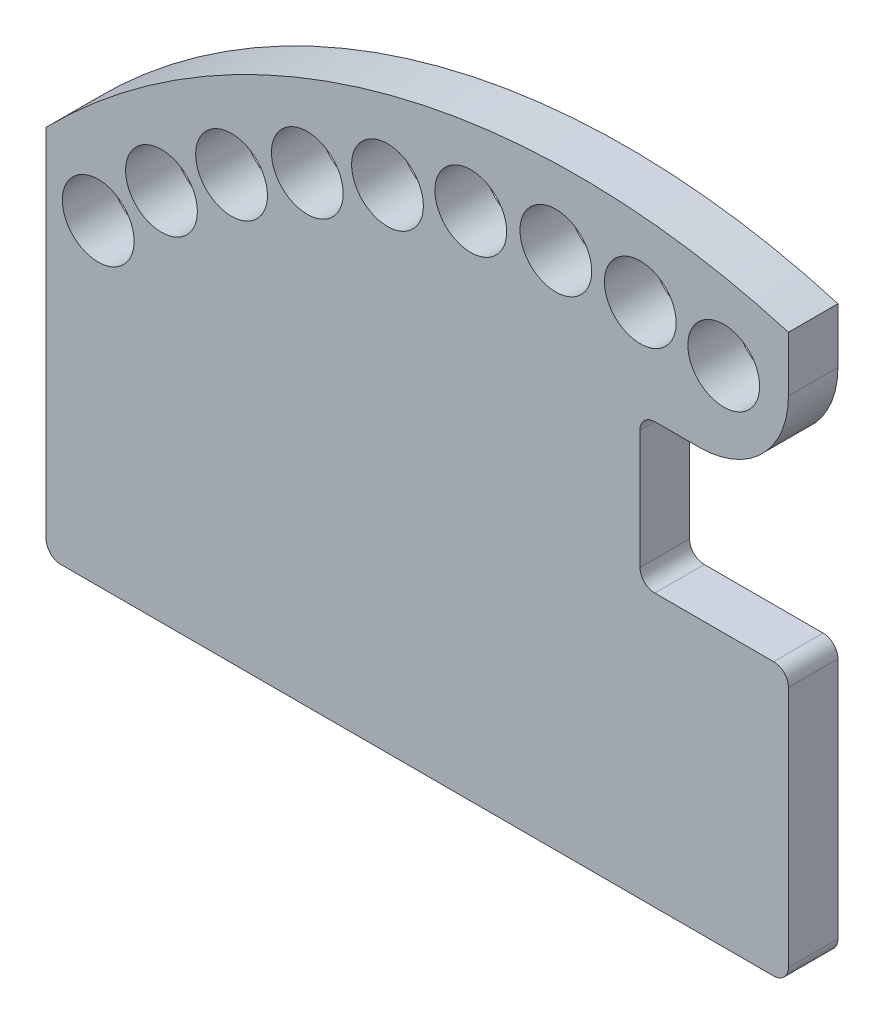
ISO-10303-21;
HEADER;
FILE_DESCRIPTION(('STEP AP214'),'2;1');
FILE_NAME('part.step','',(''),(''),'','','');
FILE_SCHEMA(('AUTOMOTIVE_DESIGN { 1 0 10303 214 1 1 1 1 }'));
ENDSEC;
DATA;
#1=APPLICATION_CONTEXT('core data for automotive mechanical design processes');
#2=APPLICATION_PROTOCOL_DEFINITION('international standard','automotive_design',2000,#1);
#3=PRODUCT_CONTEXT('',#1,'mechanical');
#4=PRODUCT('Part','Part','',(#3));
#5=PRODUCT_RELATED_PRODUCT_CATEGORY('part','',(#4));
#6=PRODUCT_DEFINITION_FORMATION('','',#4);
#7=PRODUCT_DEFINITION_CONTEXT('part definition',#1,'design');
#8=PRODUCT_DEFINITION('design','',#6,#7);
#9=PRODUCT_DEFINITION_SHAPE('','',#8);
#10=(LENGTH_UNIT() NAMED_UNIT(*) SI_UNIT(.MILLI.,.METRE.));
#11=(NAMED_UNIT(*) PLANE_ANGLE_UNIT() SI_UNIT($,.RADIAN.));
#12=(NAMED_UNIT(*) SI_UNIT($,.STERADIAN.) SOLID_ANGLE_UNIT());
#13=UNCERTAINTY_MEASURE_WITH_UNIT(LENGTH_MEASURE(1.E-05),#10,'distance_accuracy_value','');
#14=(GEOMETRIC_REPRESENTATION_CONTEXT(3) GLOBAL_UNCERTAINTY_ASSIGNED_CONTEXT((#13)) GLOBAL_UNIT_ASSIGNED_CONTEXT((#10,
#11,#12)) REPRESENTATION_CONTEXT('',''));
#15=CARTESIAN_POINT('',(0.,0.,0.));
#16=DIRECTION('',(0.,0.,1.));
#17=DIRECTION('',(1.,0.,0.));
#18=AXIS2_PLACEMENT_3D('',#15,#16,#17);
#19=CARTESIAN_POINT('',(75.,0.,10.));
#20=DIRECTION('',(-1.,0.,0.));
#21=DIRECTION('',(0.,-1.,0.));
#22=AXIS2_PLACEMENT_3D('',#19,#20,#21);
#23=PLANE('',#22);
#24=DIRECTION('',(0.,1.,0.));
#25=VECTOR('',#24,1.);
#26=CARTESIAN_POINT('',(75.,0.,10.));
#27=LINE('',#26,#25);
#28=CARTESIAN_POINT('',(75.,3.00000000000003,10.));
#29=VERTEX_POINT('',#28);
#30=CARTESIAN_POINT('',(75.,52.,10.));
#31=VERTEX_POINT('',#30);
#32=EDGE_CURVE('E142',#29,#31,#27,.T.);
#33=ORIENTED_EDGE('',*,*,#32,.F.);
#34=DIRECTION('',(0.,0.,-1.));
#35=VECTOR('',#34,1.);
#36=CARTESIAN_POINT('',(75.,3.00000000000003,10.));
#37=LINE('',#36,#35);
#38=CARTESIAN_POINT('',(75.,3.00000000000003,0.));
#39=VERTEX_POINT('',#38);
#40=EDGE_CURVE('E193',#29,#39,#37,.T.);
#41=ORIENTED_EDGE('',*,*,#40,.T.);
#42=DIRECTION('',(0.,1.,0.));
#43=VECTOR('',#42,1.);
#44=CARTESIAN_POINT('',(75.,0.,0.));
#45=LINE('',#44,#43);
#46=CARTESIAN_POINT('',(75.,52.,0.));
#47=VERTEX_POINT('',#46);
#48=EDGE_CURVE('E299',#39,#47,#45,.T.);
#49=ORIENTED_EDGE('',*,*,#48,.T.);
#50=DIRECTION('',(0.,0.,1.));
#51=VECTOR('',#50,1.);
#52=CARTESIAN_POINT('',(75.,52.,10.));
#53=LINE('',#52,#51);
#54=EDGE_CURVE('E190',#47,#31,#53,.T.);
#55=ORIENTED_EDGE('',*,*,#54,.T.);
#56=EDGE_LOOP('',(#33,#41,#49,#55));
#57=FACE_BOUND('',#56,.T.);
#58=ADVANCED_FACE('F32',(#57),#23,.F.);
#59=CARTESIAN_POINT('',(75.,103.,10.));
#60=VERTEX_POINT('',#59);
#61=CARTESIAN_POINT('',(75.,114.135353053996,10.));
#62=VERTEX_POINT('',#61);
#63=EDGE_CURVE('E131',#60,#62,#27,.T.);
#64=ORIENTED_EDGE('',*,*,#63,.F.);
#65=DIRECTION('',(0.,0.,1.));
#66=VECTOR('',#65,1.);
#67=CARTESIAN_POINT('',(75.,103.,10.));
#68=LINE('',#67,#66);
#69=CARTESIAN_POINT('',(75.,103.,0.));
#70=VERTEX_POINT('',#69);
#71=EDGE_CURVE('E167',#60,#70,#68,.F.);
#72=ORIENTED_EDGE('',*,*,#71,.T.);
#73=CARTESIAN_POINT('',(75.,114.135353053996,0.));
#74=VERTEX_POINT('',#73);
#75=EDGE_CURVE('E156',#70,#74,#45,.T.);
#76=ORIENTED_EDGE('',*,*,#75,.T.);
#77=DIRECTION('',(0.,0.,-1.));
#78=VECTOR('',#77,1.);
#79=CARTESIAN_POINT('',(75.,114.135353053996,10.));
#80=LINE('',#79,#78);
#81=EDGE_CURVE('E148',#62,#74,#80,.T.);
#82=ORIENTED_EDGE('',*,*,#81,.F.);
#83=EDGE_LOOP('',(#64,#72,#76,#82));
#84=FACE_BOUND('',#83,.T.);
#85=ADVANCED_FACE('F154',(#84),#23,.F.);
#86=CARTESIAN_POINT('',(32.5,-30.,10.));
#87=DIRECTION('',(0.,0.,-1.));
#88=DIRECTION('',(-1.,0.,0.));
#89=AXIS2_PLACEMENT_3D('',#86,#87,#88);
#90=CYLINDRICAL_SURFACE('',#89,150.270589271487);
#91=CARTESIAN_POINT('',(32.5,-30.,0.));
#92=DIRECTION('',(0.,0.,1.));
#93=DIRECTION('',(-1.,0.,0.));
#94=AXIS2_PLACEMENT_3D('',#91,#92,#93);
#95=CIRCLE('',#94,150.270589271487);
#96=CARTESIAN_POINT('',(-75.,75.,0.));
#97=VERTEX_POINT('',#96);
#98=EDGE_CURVE('E302',#74,#97,#95,.T.);
#99=ORIENTED_EDGE('',*,*,#98,.T.);
#100=DIRECTION('',(0.,0.,-1.));
#101=VECTOR('',#100,1.);
#102=CARTESIAN_POINT('',(-75.,75.,10.));
#103=LINE('',#102,#101);
#104=CARTESIAN_POINT('',(-75.,75.,10.));
#105=VERTEX_POINT('',#104);
#106=EDGE_CURVE('E150',#105,#97,#103,.T.);
#107=ORIENTED_EDGE('',*,*,#106,.F.);
#108=CARTESIAN_POINT('',(32.5,-30.,10.));
#109=DIRECTION('',(0.,0.,1.));
#110=DIRECTION('',(-1.,0.,0.));
#111=AXIS2_PLACEMENT_3D('',#108,#109,#110);
#112=CIRCLE('',#111,150.270589271487);
#113=EDGE_CURVE('E135',#62,#105,#112,.T.);
#114=ORIENTED_EDGE('',*,*,#113,.F.);
#115=ORIENTED_EDGE('',*,*,#81,.T.);
#116=EDGE_LOOP('',(#99,#107,#114,#115));
#117=FACE_BOUND('',#116,.T.);
#118=ADVANCED_FACE('F147',(#117),#90,.T.);
#119=CARTESIAN_POINT('',(-75.,0.,10.));
#120=DIRECTION('',(1.,0.,0.));
#121=DIRECTION('',(0.,0.,-1.));
#122=AXIS2_PLACEMENT_3D('',#119,#120,#121);
#123=PLANE('',#122);
#124=DIRECTION('',(0.,-1.,0.));
#125=VECTOR('',#124,1.);
#126=CARTESIAN_POINT('',(-75.,0.,0.));
#127=LINE('',#126,#125);
#128=CARTESIAN_POINT('',(-75.,2.99999999999998,0.));
#129=VERTEX_POINT('',#128);
#130=EDGE_CURVE('E304',#97,#129,#127,.T.);
#131=ORIENTED_EDGE('',*,*,#130,.T.);
#132=DIRECTION('',(0.,0.,-1.));
#133=VECTOR('',#132,1.);
#134=CARTESIAN_POINT('',(-75.,2.99999999999998,10.));
#135=LINE('',#134,#133);
#136=CARTESIAN_POINT('',(-75.,2.99999999999998,10.));
#137=VERTEX_POINT('',#136);
#138=EDGE_CURVE('E182',#129,#137,#135,.F.);
#139=ORIENTED_EDGE('',*,*,#138,.T.);
#140=DIRECTION('',(0.,-1.,0.));
#141=VECTOR('',#140,1.);
#142=CARTESIAN_POINT('',(-75.,0.,10.));
#143=LINE('',#142,#141);
#144=EDGE_CURVE('E152',#105,#137,#143,.T.);
#145=ORIENTED_EDGE('',*,*,#144,.F.);
#146=ORIENTED_EDGE('',*,*,#106,.T.);
#147=EDGE_LOOP('',(#131,#139,#145,#146));
#148=FACE_BOUND('',#147,.T.);
#149=ADVANCED_FACE('F516',(#148),#123,.F.);
#150=CARTESIAN_POINT('',(75.,0.,10.));
#151=DIRECTION('',(0.,1.,0.));
#152=DIRECTION('',(-1.,0.,0.));
#153=AXIS2_PLACEMENT_3D('',#150,#151,#152);
#154=PLANE('',#153);
#155=DIRECTION('',(1.,0.,0.));
#156=VECTOR('',#155,1.);
#157=CARTESIAN_POINT('',(75.,0.,10.));
#158=LINE('',#157,#156);
#159=CARTESIAN_POINT('',(-72.,0.,10.));
#160=VERTEX_POINT('',#159);
#161=CARTESIAN_POINT('',(72.,0.,10.));
#162=VERTEX_POINT('',#161);
#163=EDGE_CURVE('E162',#160,#162,#158,.T.);
#164=ORIENTED_EDGE('',*,*,#163,.F.);
#165=DIRECTION('',(0.,0.,-1.));
#166=VECTOR('',#165,1.);
#167=CARTESIAN_POINT('',(-72.,0.,10.));
#168=LINE('',#167,#166);
#169=CARTESIAN_POINT('',(-72.,0.,0.));
#170=VERTEX_POINT('',#169);
#171=EDGE_CURVE('E173',#160,#170,#168,.T.);
#172=ORIENTED_EDGE('',*,*,#171,.T.);
#173=DIRECTION('',(1.,0.,0.));
#174=VECTOR('',#173,1.);
#175=CARTESIAN_POINT('',(75.,0.,0.));
#176=LINE('',#175,#174);
#177=CARTESIAN_POINT('',(72.,0.,0.));
#178=VERTEX_POINT('',#177);
#179=EDGE_CURVE('E143',#170,#178,#176,.T.);
#180=ORIENTED_EDGE('',*,*,#179,.T.);
#181=DIRECTION('',(0.,0.,-1.));
#182=VECTOR('',#181,1.);
#183=CARTESIAN_POINT('',(72.,0.,10.));
#184=LINE('',#183,#182);
#185=EDGE_CURVE('E171',#178,#162,#184,.F.);
#186=ORIENTED_EDGE('',*,*,#185,.T.);
#187=EDGE_LOOP('',(#164,#172,#180,#186));
#188=FACE_BOUND('',#187,.T.);
#189=ADVANCED_FACE('F310',(#188),#154,.F.);
#190=CARTESIAN_POINT('',(32.5,-30.,10.));
#191=DIRECTION('',(0.,0.,-1.));
#192=DIRECTION('',(-1.,0.,0.));
#193=AXIS2_PLACEMENT_3D('',#190,#191,#192);
#194=PLANE('',#193);
#195=CARTESIAN_POINT('',(61.9258524461941,101.754010215305,10.));
#196=DIRECTION('',(0.,0.,1.));
#197=DIRECTION('',(0.968147640378108,-0.250380004054442,0.));
#198=AXIS2_PLACEMENT_3D('',#195,#196,#197);
#199=CIRCLE('',#198,7.25000000000001);
#200=CARTESIAN_POINT('',(68.9449228389354,99.9387551859108,10.));
#201=VERTEX_POINT('',#200);
#202=EDGE_CURVE('E234',#201,#201,#199,.T.);
#203=ORIENTED_EDGE('',*,*,#202,.F.);
#204=EDGE_LOOP('',(#203));
#205=FACE_BOUND('',#204,.T.);
#206=CARTESIAN_POINT('',(45.0633710064863,104.414142518387,10.));
#207=DIRECTION('',(0.,0.,1.));
#208=DIRECTION('',(0.992004949679715,-0.12619896913583,0.));
#209=AXIS2_PLACEMENT_3D('',#206,#207,#208);
#210=CIRCLE('',#209,7.25000000000001);
#211=CARTESIAN_POINT('',(52.2554068916642,103.499199992153,10.));
#212=VERTEX_POINT('',#211);
#213=EDGE_CURVE('E245',#212,#212,#210,.T.);
#214=ORIENTED_EDGE('',*,*,#213,.F.);
#215=EDGE_LOOP('',(#214));
#216=FACE_BOUND('',#215,.T.);
#217=CARTESIAN_POINT('',(-64.4637952556092,63.9309448990496,10.));
#218=DIRECTION('',(0.,0.,1.));
#219=DIRECTION('',(0.71933980033865,0.694658370458998,0.));
#220=AXIS2_PLACEMENT_3D('',#217,#218,#219);
#221=CIRCLE('',#220,7.25000000000001);
#222=CARTESIAN_POINT('',(-59.248581703154,68.9672180848773,10.));
#223=VERTEX_POINT('',#222);
#224=EDGE_CURVE('E251',#223,#223,#221,.T.);
#225=ORIENTED_EDGE('',*,*,#224,.F.);
#226=EDGE_LOOP('',(#225));
#227=FACE_BOUND('',#226,.T.);
#228=CARTESIAN_POINT('',(-51.6811649051759,75.5392413996215,10.));
#229=DIRECTION('',(0.,0.,1.));
#230=DIRECTION('',(0.802123192755043,0.597158591702787,0.));
#231=AXIS2_PLACEMENT_3D('',#228,#229,#230);
#232=CIRCLE('',#231,7.25000000000001);
#233=CARTESIAN_POINT('',(-45.8657717577018,79.8686411894667,10.));
#234=VERTEX_POINT('',#233);
#235=EDGE_CURVE('E257',#234,#234,#232,.T.);
#236=ORIENTED_EDGE('',*,*,#235,.F.);
#237=EDGE_LOOP('',(#236));
#238=FACE_BOUND('',#237,.T.);
#239=CARTESIAN_POINT('',(-37.5213898831997,85.4209901136918,10.));
#240=DIRECTION('',(0.,0.,1.));
#241=DIRECTION('',(0.871784413696762,0.489889718238088,0.));
#242=AXIS2_PLACEMENT_3D('',#239,#240,#241);
#243=CIRCLE('',#242,7.25000000000001);
#244=CARTESIAN_POINT('',(-31.2009528838981,88.972690570918,10.));
#245=VERTEX_POINT('',#244);
#246=EDGE_CURVE('E263',#245,#245,#243,.T.);
#247=ORIENTED_EDGE('',*,*,#246,.F.);
#248=EDGE_LOOP('',(#247));
#249=FACE_BOUND('',#248,.T.);
#250=CARTESIAN_POINT('',(-22.2161141535498,93.4145325799831,10.));
#251=DIRECTION('',(0.,0.,1.));
#252=DIRECTION('',(0.927183854566787,0.374606593415913,0.));
#253=AXIS2_PLACEMENT_3D('',#250,#251,#252);
#254=CIRCLE('',#253,7.25000000000001);
#255=CARTESIAN_POINT('',(-15.4940312079406,96.1304303822485,10.));
#256=VERTEX_POINT('',#255);
#257=EDGE_CURVE('E269',#256,#256,#254,.T.);
#258=ORIENTED_EDGE('',*,*,#257,.F.);
#259=EDGE_LOOP('',(#258));
#260=FACE_BOUND('',#259,.T.);
#261=CARTESIAN_POINT('',(-6.01572126629146,99.3891000638669,10.));
#262=DIRECTION('',(0.,0.,1.));
#263=DIRECTION('',(0.967415219462864,0.253195168104802,0.));
#264=AXIS2_PLACEMENT_3D('',#261,#262,#263);
#265=CIRCLE('',#264,7.25000000000001);
#266=CARTESIAN_POINT('',(0.998039074814315,101.224765032627,10.));
#267=VERTEX_POINT('',#266);
#268=EDGE_CURVE('E275',#267,#267,#265,.T.);
#269=ORIENTED_EDGE('',*,*,#268,.F.);
#270=EDGE_LOOP('',(#269));
#271=FACE_BOUND('',#270,.T.);
#272=CARTESIAN_POINT('',(10.8147617411529,103.246952841921,10.));
#273=DIRECTION('',(0.,0.,1.));
#274=DIRECTION('',(0.991820351541262,0.127641647860595,0.));
#275=AXIS2_PLACEMENT_3D('',#272,#273,#274);
#276=CIRCLE('',#275,7.25000000000001);
#277=CARTESIAN_POINT('',(18.0054592898271,104.17235478891,10.));
#278=VERTEX_POINT('',#277);
#279=EDGE_CURVE('E281',#278,#278,#276,.T.);
#280=ORIENTED_EDGE('',*,*,#279,.F.);
#281=EDGE_LOOP('',(#280));
#282=FACE_BOUND('',#281,.T.);
#283=CARTESIAN_POINT('',(28.,104.924979155085,10.));
#284=DIRECTION('',(0.,0.,1.));
#285=DIRECTION('',(1.,0.,0.));
#286=AXIS2_PLACEMENT_3D('',#283,#284,#285);
#287=CIRCLE('',#286,7.25000000000001);
#288=CARTESIAN_POINT('',(35.25,104.924979155085,10.));
#289=VERTEX_POINT('',#288);
#290=EDGE_CURVE('E287',#289,#289,#287,.T.);
#291=ORIENTED_EDGE('',*,*,#290,.F.);
#292=EDGE_LOOP('',(#291));
#293=FACE_BOUND('',#292,.T.);
#294=ORIENTED_EDGE('',*,*,#144,.T.);
#295=CARTESIAN_POINT('',(-72.,2.99999999999998,10.));
#296=DIRECTION('',(0.,0.,-1.));
#297=DIRECTION('',(-1.,0.,0.));
#298=AXIS2_PLACEMENT_3D('',#295,#296,#297);
#299=CIRCLE('',#298,3.);
#300=EDGE_CURVE('E188',#137,#160,#299,.F.);
#301=ORIENTED_EDGE('',*,*,#300,.T.);
#302=ORIENTED_EDGE('',*,*,#163,.T.);
#303=CARTESIAN_POINT('',(72.,3.00000000000003,10.));
#304=DIRECTION('',(0.,0.,-1.));
#305=DIRECTION('',(-1.,0.,0.));
#306=AXIS2_PLACEMENT_3D('',#303,#304,#305);
#307=CIRCLE('',#306,3.);
#308=EDGE_CURVE('E186',#162,#29,#307,.F.);
#309=ORIENTED_EDGE('',*,*,#308,.T.);
#310=ORIENTED_EDGE('',*,*,#32,.T.);
#311=CARTESIAN_POINT('',(72.,52.,10.));
#312=DIRECTION('',(0.,0.,-1.));
#313=DIRECTION('',(-1.,0.,0.));
#314=AXIS2_PLACEMENT_3D('',#311,#312,#313);
#315=CIRCLE('',#314,3.);
#316=CARTESIAN_POINT('',(72.,55.,10.));
#317=VERTEX_POINT('',#316);
#318=EDGE_CURVE('E184',#31,#317,#315,.F.);
#319=ORIENTED_EDGE('',*,*,#318,.T.);
#320=DIRECTION('',(1.,0.,0.));
#321=VECTOR('',#320,1.);
#322=CARTESIAN_POINT('',(45.,55.,10.));
#323=LINE('',#322,#321);
#324=CARTESIAN_POINT('',(48.,55.,10.));
#325=VERTEX_POINT('',#324);
#326=EDGE_CURVE('E236',#325,#317,#323,.T.);
#327=ORIENTED_EDGE('',*,*,#326,.F.);
#328=CARTESIAN_POINT('',(48.,58.,10.));
#329=DIRECTION('',(0.,0.,-1.));
#330=DIRECTION('',(-1.,0.,0.));
#331=AXIS2_PLACEMENT_3D('',#328,#329,#330);
#332=CIRCLE('',#331,3.);
#333=CARTESIAN_POINT('',(45.,58.,10.));
#334=VERTEX_POINT('',#333);
#335=EDGE_CURVE('E47',#325,#334,#332,.T.);
#336=ORIENTED_EDGE('',*,*,#335,.T.);
#337=DIRECTION('',(0.,-1.,0.));
#338=VECTOR('',#337,1.);
#339=CARTESIAN_POINT('',(45.,85.,10.));
#340=LINE('',#339,#338);
#341=CARTESIAN_POINT('',(45.,82.,10.));
#342=VERTEX_POINT('',#341);
#343=EDGE_CURVE('E211',#342,#334,#340,.T.);
#344=ORIENTED_EDGE('',*,*,#343,.F.);
#345=CARTESIAN_POINT('',(48.,82.,10.));
#346=DIRECTION('',(0.,0.,-1.));
#347=DIRECTION('',(-1.,0.,0.));
#348=AXIS2_PLACEMENT_3D('',#345,#346,#347);
#349=CIRCLE('',#348,3.);
#350=CARTESIAN_POINT('',(48.,85.,10.));
#351=VERTEX_POINT('',#350);
#352=EDGE_CURVE('E40',#342,#351,#349,.T.);
#353=ORIENTED_EDGE('',*,*,#352,.T.);
#354=DIRECTION('',(-1.,0.,0.));
#355=VECTOR('',#354,1.);
#356=CARTESIAN_POINT('',(75.,85.,10.));
#357=LINE('',#356,#355);
#358=CARTESIAN_POINT('',(57.,85.,10.));
#359=VERTEX_POINT('',#358);
#360=EDGE_CURVE('E210',#359,#351,#357,.T.);
#361=ORIENTED_EDGE('',*,*,#360,.F.);
#362=CARTESIAN_POINT('',(57.,103.,10.));
#363=DIRECTION('',(0.,0.,-1.));
#364=DIRECTION('',(-1.,0.,0.));
#365=AXIS2_PLACEMENT_3D('',#362,#363,#364);
#366=CIRCLE('',#365,18.);
#367=EDGE_CURVE('E138',#359,#60,#366,.F.);
#368=ORIENTED_EDGE('',*,*,#367,.T.);
#369=ORIENTED_EDGE('',*,*,#63,.T.);
#370=ORIENTED_EDGE('',*,*,#113,.T.);
#371=EDGE_LOOP('',(#294,#301,#302,#309,#310,#319,#327,#336,#344,#353,#361,#368,#369,#370));
#372=FACE_BOUND('',#371,.T.);
#373=ADVANCED_FACE('F134',(#205,#216,#227,#238,#249,#260,#271,#282,#293,#372),#194,.F.);
#374=CARTESIAN_POINT('',(32.5,-30.,0.));
#375=DIRECTION('',(0.,0.,-1.));
#376=DIRECTION('',(-1.,0.,0.));
#377=AXIS2_PLACEMENT_3D('',#374,#375,#376);
#378=PLANE('',#377);
#379=ORIENTED_EDGE('',*,*,#179,.F.);
#380=CARTESIAN_POINT('',(-72.,2.99999999999998,0.));
#381=DIRECTION('',(0.,0.,-1.));
#382=DIRECTION('',(-1.,0.,0.));
#383=AXIS2_PLACEMENT_3D('',#380,#381,#382);
#384=CIRCLE('',#383,3.);
#385=EDGE_CURVE('E180',#170,#129,#384,.T.);
#386=ORIENTED_EDGE('',*,*,#385,.T.);
#387=ORIENTED_EDGE('',*,*,#130,.F.);
#388=ORIENTED_EDGE('',*,*,#98,.F.);
#389=ORIENTED_EDGE('',*,*,#75,.F.);
#390=CARTESIAN_POINT('',(57.,103.,0.));
#391=DIRECTION('',(0.,0.,-1.));
#392=DIRECTION('',(-1.,0.,0.));
#393=AXIS2_PLACEMENT_3D('',#390,#391,#392);
#394=CIRCLE('',#393,18.);
#395=CARTESIAN_POINT('',(57.,85.,0.));
#396=VERTEX_POINT('',#395);
#397=EDGE_CURVE('E169',#70,#396,#394,.T.);
#398=ORIENTED_EDGE('',*,*,#397,.T.);
#399=DIRECTION('',(-1.,0.,0.));
#400=VECTOR('',#399,1.);
#401=CARTESIAN_POINT('',(75.,85.,0.));
#402=LINE('',#401,#400);
#403=CARTESIAN_POINT('',(48.,85.,0.));
#404=VERTEX_POINT('',#403);
#405=EDGE_CURVE('E227',#396,#404,#402,.T.);
#406=ORIENTED_EDGE('',*,*,#405,.T.);
#407=CARTESIAN_POINT('',(48.,82.,0.));
#408=DIRECTION('',(0.,0.,-1.));
#409=DIRECTION('',(-1.,0.,0.));
#410=AXIS2_PLACEMENT_3D('',#407,#408,#409);
#411=CIRCLE('',#410,3.);
#412=CARTESIAN_POINT('',(45.,82.,0.));
#413=VERTEX_POINT('',#412);
#414=EDGE_CURVE('E11',#404,#413,#411,.F.);
#415=ORIENTED_EDGE('',*,*,#414,.T.);
#416=DIRECTION('',(0.,-1.,0.));
#417=VECTOR('',#416,1.);
#418=CARTESIAN_POINT('',(45.,85.,0.));
#419=LINE('',#418,#417);
#420=CARTESIAN_POINT('',(45.,58.,0.));
#421=VERTEX_POINT('',#420);
#422=EDGE_CURVE('E225',#413,#421,#419,.T.);
#423=ORIENTED_EDGE('',*,*,#422,.T.);
#424=CARTESIAN_POINT('',(48.,58.,0.));
#425=DIRECTION('',(0.,0.,-1.));
#426=DIRECTION('',(-1.,0.,0.));
#427=AXIS2_PLACEMENT_3D('',#424,#425,#426);
#428=CIRCLE('',#427,3.);
#429=CARTESIAN_POINT('',(48.,55.,0.));
#430=VERTEX_POINT('',#429);
#431=EDGE_CURVE('E208',#421,#430,#428,.F.);
#432=ORIENTED_EDGE('',*,*,#431,.T.);
#433=DIRECTION('',(1.,0.,0.));
#434=VECTOR('',#433,1.);
#435=CARTESIAN_POINT('',(45.,55.,0.));
#436=LINE('',#435,#434);
#437=CARTESIAN_POINT('',(72.,55.,0.));
#438=VERTEX_POINT('',#437);
#439=EDGE_CURVE('E231',#430,#438,#436,.T.);
#440=ORIENTED_EDGE('',*,*,#439,.T.);
#441=CARTESIAN_POINT('',(72.,52.,0.));
#442=DIRECTION('',(0.,0.,-1.));
#443=DIRECTION('',(-1.,0.,0.));
#444=AXIS2_PLACEMENT_3D('',#441,#442,#443);
#445=CIRCLE('',#444,3.);
#446=EDGE_CURVE('E176',#438,#47,#445,.T.);
#447=ORIENTED_EDGE('',*,*,#446,.T.);
#448=ORIENTED_EDGE('',*,*,#48,.F.);
#449=CARTESIAN_POINT('',(72.,3.00000000000003,0.));
#450=DIRECTION('',(0.,0.,-1.));
#451=DIRECTION('',(-1.,0.,0.));
#452=AXIS2_PLACEMENT_3D('',#449,#450,#451);
#453=CIRCLE('',#452,3.);
#454=EDGE_CURVE('E178',#39,#178,#453,.T.);
#455=ORIENTED_EDGE('',*,*,#454,.T.);
#456=EDGE_LOOP('',(#379,#386,#387,#388,#389,#398,#406,#415,#423,#432,#440,#447,#448,#455));
#457=FACE_BOUND('',#456,.T.);
#458=CARTESIAN_POINT('',(61.9258524461941,101.754010215305,0.));
#459=DIRECTION('',(0.,0.,1.));
#460=DIRECTION('',(0.968147640378108,-0.250380004054442,0.));
#461=AXIS2_PLACEMENT_3D('',#458,#459,#460);
#462=CIRCLE('',#461,7.25000000000001);
#463=CARTESIAN_POINT('',(68.9449228389354,99.9387551859108,0.));
#464=VERTEX_POINT('',#463);
#465=EDGE_CURVE('E242',#464,#464,#462,.T.);
#466=ORIENTED_EDGE('',*,*,#465,.T.);
#467=EDGE_LOOP('',(#466));
#468=FACE_BOUND('',#467,.T.);
#469=CARTESIAN_POINT('',(45.0633710064863,104.414142518387,0.));
#470=DIRECTION('',(0.,0.,1.));
#471=DIRECTION('',(0.992004949679715,-0.12619896913583,0.));
#472=AXIS2_PLACEMENT_3D('',#469,#470,#471);
#473=CIRCLE('',#472,7.25000000000001);
#474=CARTESIAN_POINT('',(52.2554068916642,103.499199992153,0.));
#475=VERTEX_POINT('',#474);
#476=EDGE_CURVE('E248',#475,#475,#473,.T.);
#477=ORIENTED_EDGE('',*,*,#476,.T.);
#478=EDGE_LOOP('',(#477));
#479=FACE_BOUND('',#478,.T.);
#480=CARTESIAN_POINT('',(-64.4637952556092,63.9309448990496,0.));
#481=DIRECTION('',(0.,0.,1.));
#482=DIRECTION('',(0.71933980033865,0.694658370458998,0.));
#483=AXIS2_PLACEMENT_3D('',#480,#481,#482);
#484=CIRCLE('',#483,7.25000000000001);
#485=CARTESIAN_POINT('',(-59.248581703154,68.9672180848773,0.));
#486=VERTEX_POINT('',#485);
#487=EDGE_CURVE('E254',#486,#486,#484,.T.);
#488=ORIENTED_EDGE('',*,*,#487,.T.);
#489=EDGE_LOOP('',(#488));
#490=FACE_BOUND('',#489,.T.);
#491=CARTESIAN_POINT('',(-51.6811649051759,75.5392413996215,0.));
#492=DIRECTION('',(0.,0.,1.));
#493=DIRECTION('',(0.802123192755043,0.597158591702787,0.));
#494=AXIS2_PLACEMENT_3D('',#491,#492,#493);
#495=CIRCLE('',#494,7.25000000000001);
#496=CARTESIAN_POINT('',(-45.8657717577018,79.8686411894667,0.));
#497=VERTEX_POINT('',#496);
#498=EDGE_CURVE('E260',#497,#497,#495,.T.);
#499=ORIENTED_EDGE('',*,*,#498,.T.);
#500=EDGE_LOOP('',(#499));
#501=FACE_BOUND('',#500,.T.);
#502=CARTESIAN_POINT('',(-37.5213898831997,85.4209901136918,0.));
#503=DIRECTION('',(0.,0.,1.));
#504=DIRECTION('',(0.871784413696762,0.489889718238088,0.));
#505=AXIS2_PLACEMENT_3D('',#502,#503,#504);
#506=CIRCLE('',#505,7.25000000000001);
#507=CARTESIAN_POINT('',(-31.2009528838981,88.972690570918,0.));
#508=VERTEX_POINT('',#507);
#509=EDGE_CURVE('E266',#508,#508,#506,.T.);
#510=ORIENTED_EDGE('',*,*,#509,.T.);
#511=EDGE_LOOP('',(#510));
#512=FACE_BOUND('',#511,.T.);
#513=CARTESIAN_POINT('',(-22.2161141535498,93.4145325799831,0.));
#514=DIRECTION('',(0.,0.,1.));
#515=DIRECTION('',(0.927183854566787,0.374606593415913,0.));
#516=AXIS2_PLACEMENT_3D('',#513,#514,#515);
#517=CIRCLE('',#516,7.25000000000001);
#518=CARTESIAN_POINT('',(-15.4940312079406,96.1304303822485,0.));
#519=VERTEX_POINT('',#518);
#520=EDGE_CURVE('E272',#519,#519,#517,.T.);
#521=ORIENTED_EDGE('',*,*,#520,.T.);
#522=EDGE_LOOP('',(#521));
#523=FACE_BOUND('',#522,.T.);
#524=CARTESIAN_POINT('',(-6.01572126629146,99.3891000638669,0.));
#525=DIRECTION('',(0.,0.,1.));
#526=DIRECTION('',(0.967415219462864,0.253195168104802,0.));
#527=AXIS2_PLACEMENT_3D('',#524,#525,#526);
#528=CIRCLE('',#527,7.25000000000001);
#529=CARTESIAN_POINT('',(0.998039074814315,101.224765032627,0.));
#530=VERTEX_POINT('',#529);
#531=EDGE_CURVE('E278',#530,#530,#528,.T.);
#532=ORIENTED_EDGE('',*,*,#531,.T.);
#533=EDGE_LOOP('',(#532));
#534=FACE_BOUND('',#533,.T.);
#535=CARTESIAN_POINT('',(10.8147617411529,103.246952841921,0.));
#536=DIRECTION('',(0.,0.,1.));
#537=DIRECTION('',(0.991820351541262,0.127641647860595,0.));
#538=AXIS2_PLACEMENT_3D('',#535,#536,#537);
#539=CIRCLE('',#538,7.25000000000001);
#540=CARTESIAN_POINT('',(18.0054592898271,104.17235478891,0.));
#541=VERTEX_POINT('',#540);
#542=EDGE_CURVE('E284',#541,#541,#539,.T.);
#543=ORIENTED_EDGE('',*,*,#542,.T.);
#544=EDGE_LOOP('',(#543));
#545=FACE_BOUND('',#544,.T.);
#546=CARTESIAN_POINT('',(28.,104.924979155085,0.));
#547=DIRECTION('',(0.,0.,1.));
#548=DIRECTION('',(1.,0.,0.));
#549=AXIS2_PLACEMENT_3D('',#546,#547,#548);
#550=CIRCLE('',#549,7.25000000000001);
#551=CARTESIAN_POINT('',(35.25,104.924979155085,0.));
#552=VERTEX_POINT('',#551);
#553=EDGE_CURVE('E290',#552,#552,#550,.T.);
#554=ORIENTED_EDGE('',*,*,#553,.T.);
#555=EDGE_LOOP('',(#554));
#556=FACE_BOUND('',#555,.T.);
#557=ADVANCED_FACE('F223',(#457,#468,#479,#490,#501,#512,#523,#534,#545,#556),#378,.T.);
#558=CARTESIAN_POINT('',(28.,104.924979155085,0.));
#559=DIRECTION('',(0.,0.,1.));
#560=DIRECTION('',(1.,0.,0.));
#561=AXIS2_PLACEMENT_3D('',#558,#559,#560);
#562=CYLINDRICAL_SURFACE('',#561,7.25000000000001);
#563=ORIENTED_EDGE('',*,*,#553,.F.);
#564=EDGE_LOOP('',(#563));
#565=FACE_BOUND('',#564,.T.);
#566=ORIENTED_EDGE('',*,*,#290,.T.);
#567=EDGE_LOOP('',(#566));
#568=FACE_BOUND('',#567,.T.);
#569=ADVANCED_FACE('F484',(#565,#568),#562,.F.);
#570=CARTESIAN_POINT('',(10.8147617411529,103.246952841921,0.));
#571=DIRECTION('',(0.,0.,1.));
#572=DIRECTION('',(1.,0.,0.));
#573=AXIS2_PLACEMENT_3D('',#570,#571,#572);
#574=CYLINDRICAL_SURFACE('',#573,7.25000000000001);
#575=ORIENTED_EDGE('',*,*,#542,.F.);
#576=EDGE_LOOP('',(#575));
#577=FACE_BOUND('',#576,.T.);
#578=ORIENTED_EDGE('',*,*,#279,.T.);
#579=EDGE_LOOP('',(#578));
#580=FACE_BOUND('',#579,.T.);
#581=ADVANCED_FACE('F475',(#577,#580),#574,.F.);
#582=CARTESIAN_POINT('',(-6.01572126629146,99.3891000638669,0.));
#583=DIRECTION('',(0.,0.,1.));
#584=DIRECTION('',(1.,0.,0.));
#585=AXIS2_PLACEMENT_3D('',#582,#583,#584);
#586=CYLINDRICAL_SURFACE('',#585,7.25000000000001);
#587=ORIENTED_EDGE('',*,*,#531,.F.);
#588=EDGE_LOOP('',(#587));
#589=FACE_BOUND('',#588,.T.);
#590=ORIENTED_EDGE('',*,*,#268,.T.);
#591=EDGE_LOOP('',(#590));
#592=FACE_BOUND('',#591,.T.);
#593=ADVANCED_FACE('F466',(#589,#592),#586,.F.);
#594=CARTESIAN_POINT('',(-22.2161141535498,93.4145325799831,0.));
#595=DIRECTION('',(0.,0.,1.));
#596=DIRECTION('',(1.,0.,0.));
#597=AXIS2_PLACEMENT_3D('',#594,#595,#596);
#598=CYLINDRICAL_SURFACE('',#597,7.25000000000001);
#599=ORIENTED_EDGE('',*,*,#520,.F.);
#600=EDGE_LOOP('',(#599));
#601=FACE_BOUND('',#600,.T.);
#602=ORIENTED_EDGE('',*,*,#257,.T.);
#603=EDGE_LOOP('',(#602));
#604=FACE_BOUND('',#603,.T.);
#605=ADVANCED_FACE('F457',(#601,#604),#598,.F.);
#606=CARTESIAN_POINT('',(-37.5213898831997,85.4209901136918,0.));
#607=DIRECTION('',(0.,0.,1.));
#608=DIRECTION('',(1.,0.,0.));
#609=AXIS2_PLACEMENT_3D('',#606,#607,#608);
#610=CYLINDRICAL_SURFACE('',#609,7.25000000000001);
#611=ORIENTED_EDGE('',*,*,#509,.F.);
#612=EDGE_LOOP('',(#611));
#613=FACE_BOUND('',#612,.T.);
#614=ORIENTED_EDGE('',*,*,#246,.T.);
#615=EDGE_LOOP('',(#614));
#616=FACE_BOUND('',#615,.T.);
#617=ADVANCED_FACE('F448',(#613,#616),#610,.F.);
#618=CARTESIAN_POINT('',(-51.6811649051759,75.5392413996215,0.));
#619=DIRECTION('',(0.,0.,1.));
#620=DIRECTION('',(1.,0.,0.));
#621=AXIS2_PLACEMENT_3D('',#618,#619,#620);
#622=CYLINDRICAL_SURFACE('',#621,7.25000000000001);
#623=ORIENTED_EDGE('',*,*,#498,.F.);
#624=EDGE_LOOP('',(#623));
#625=FACE_BOUND('',#624,.T.);
#626=ORIENTED_EDGE('',*,*,#235,.T.);
#627=EDGE_LOOP('',(#626));
#628=FACE_BOUND('',#627,.T.);
#629=ADVANCED_FACE('F439',(#625,#628),#622,.F.);
#630=CARTESIAN_POINT('',(-64.4637952556092,63.9309448990496,0.));
#631=DIRECTION('',(0.,0.,1.));
#632=DIRECTION('',(1.,0.,0.));
#633=AXIS2_PLACEMENT_3D('',#630,#631,#632);
#634=CYLINDRICAL_SURFACE('',#633,7.25000000000001);
#635=ORIENTED_EDGE('',*,*,#487,.F.);
#636=EDGE_LOOP('',(#635));
#637=FACE_BOUND('',#636,.T.);
#638=ORIENTED_EDGE('',*,*,#224,.T.);
#639=EDGE_LOOP('',(#638));
#640=FACE_BOUND('',#639,.T.);
#641=ADVANCED_FACE('F430',(#637,#640),#634,.F.);
#642=CARTESIAN_POINT('',(45.0633710064863,104.414142518387,0.));
#643=DIRECTION('',(0.,0.,1.));
#644=DIRECTION('',(1.,0.,0.));
#645=AXIS2_PLACEMENT_3D('',#642,#643,#644);
#646=CYLINDRICAL_SURFACE('',#645,7.25000000000001);
#647=ORIENTED_EDGE('',*,*,#476,.F.);
#648=EDGE_LOOP('',(#647));
#649=FACE_BOUND('',#648,.T.);
#650=ORIENTED_EDGE('',*,*,#213,.T.);
#651=EDGE_LOOP('',(#650));
#652=FACE_BOUND('',#651,.T.);
#653=ADVANCED_FACE('F421',(#649,#652),#646,.F.);
#654=CARTESIAN_POINT('',(61.9258524461941,101.754010215305,0.));
#655=DIRECTION('',(0.,0.,1.));
#656=DIRECTION('',(1.,0.,0.));
#657=AXIS2_PLACEMENT_3D('',#654,#655,#656);
#658=CYLINDRICAL_SURFACE('',#657,7.25000000000001);
#659=ORIENTED_EDGE('',*,*,#465,.F.);
#660=EDGE_LOOP('',(#659));
#661=FACE_BOUND('',#660,.T.);
#662=ORIENTED_EDGE('',*,*,#202,.T.);
#663=EDGE_LOOP('',(#662));
#664=FACE_BOUND('',#663,.T.);
#665=ADVANCED_FACE('F407',(#661,#664),#658,.F.);
#666=CARTESIAN_POINT('',(45.,55.,0.));
#667=DIRECTION('',(0.,-1.,0.));
#668=DIRECTION('',(0.,0.,-1.));
#669=AXIS2_PLACEMENT_3D('',#666,#667,#668);
#670=PLANE('',#669);
#671=ORIENTED_EDGE('',*,*,#326,.T.);
#672=DIRECTION('',(0.,0.,1.));
#673=VECTOR('',#672,1.);
#674=CARTESIAN_POINT('',(72.,55.,0.));
#675=LINE('',#674,#673);
#676=EDGE_CURVE('E199',#317,#438,#675,.F.);
#677=ORIENTED_EDGE('',*,*,#676,.T.);
#678=ORIENTED_EDGE('',*,*,#439,.F.);
#679=DIRECTION('',(0.,0.,1.));
#680=VECTOR('',#679,1.);
#681=CARTESIAN_POINT('',(48.,55.,10.));
#682=LINE('',#681,#680);
#683=EDGE_CURVE('E196',#430,#325,#682,.T.);
#684=ORIENTED_EDGE('',*,*,#683,.T.);
#685=EDGE_LOOP('',(#671,#677,#678,#684));
#686=FACE_BOUND('',#685,.T.);
#687=ADVANCED_FACE('F325',(#686),#670,.F.);
#688=CARTESIAN_POINT('',(45.,85.,0.));
#689=DIRECTION('',(-1.,0.,0.));
#690=DIRECTION('',(0.,-1.,0.));
#691=AXIS2_PLACEMENT_3D('',#688,#689,#690);
#692=PLANE('',#691);
#693=ORIENTED_EDGE('',*,*,#343,.T.);
#694=DIRECTION('',(0.,0.,1.));
#695=VECTOR('',#694,1.);
#696=CARTESIAN_POINT('',(45.,58.,0.));
#697=LINE('',#696,#695);
#698=EDGE_CURVE('E203',#334,#421,#697,.F.);
#699=ORIENTED_EDGE('',*,*,#698,.T.);
#700=ORIENTED_EDGE('',*,*,#422,.F.);
#701=DIRECTION('',(0.,0.,1.));
#702=VECTOR('',#701,1.);
#703=CARTESIAN_POINT('',(45.,82.,10.));
#704=LINE('',#703,#702);
#705=EDGE_CURVE('E201',#413,#342,#704,.T.);
#706=ORIENTED_EDGE('',*,*,#705,.T.);
#707=EDGE_LOOP('',(#693,#699,#700,#706));
#708=FACE_BOUND('',#707,.T.);
#709=ADVANCED_FACE('F229',(#708),#692,.F.);
#710=CARTESIAN_POINT('',(75.,85.,0.));
#711=DIRECTION('',(0.,1.,0.));
#712=DIRECTION('',(-1.,0.,0.));
#713=AXIS2_PLACEMENT_3D('',#710,#711,#712);
#714=PLANE('',#713);
#715=ORIENTED_EDGE('',*,*,#360,.T.);
#716=DIRECTION('',(0.,0.,1.));
#717=VECTOR('',#716,1.);
#718=CARTESIAN_POINT('',(48.,85.,0.));
#719=LINE('',#718,#717);
#720=EDGE_CURVE('E205',#351,#404,#719,.F.);
#721=ORIENTED_EDGE('',*,*,#720,.T.);
#722=ORIENTED_EDGE('',*,*,#405,.F.);
#723=DIRECTION('',(0.,0.,1.));
#724=VECTOR('',#723,1.);
#725=CARTESIAN_POINT('',(57.,85.,0.));
#726=LINE('',#725,#724);
#727=EDGE_CURVE('E158',#396,#359,#726,.T.);
#728=ORIENTED_EDGE('',*,*,#727,.T.);
#729=EDGE_LOOP('',(#715,#721,#722,#728));
#730=FACE_BOUND('',#729,.T.);
#731=ADVANCED_FACE('F213',(#730),#714,.F.);
#732=CARTESIAN_POINT('',(57.,103.,0.));
#733=DIRECTION('',(0.,0.,1.));
#734=DIRECTION('',(1.,0.,0.));
#735=AXIS2_PLACEMENT_3D('',#732,#733,#734);
#736=CYLINDRICAL_SURFACE('',#735,18.);
#737=ORIENTED_EDGE('',*,*,#397,.F.);
#738=ORIENTED_EDGE('',*,*,#71,.F.);
#739=ORIENTED_EDGE('',*,*,#367,.F.);
#740=ORIENTED_EDGE('',*,*,#727,.F.);
#741=EDGE_LOOP('',(#737,#738,#739,#740));
#742=FACE_BOUND('',#741,.T.);
#743=ADVANCED_FACE('F344',(#742),#736,.T.);
#744=CARTESIAN_POINT('',(-72.,2.99999999999998,10.));
#745=DIRECTION('',(0.,0.,-1.));
#746=DIRECTION('',(-1.,0.,0.));
#747=AXIS2_PLACEMENT_3D('',#744,#745,#746);
#748=CYLINDRICAL_SURFACE('',#747,3.);
#749=ORIENTED_EDGE('',*,*,#300,.F.);
#750=ORIENTED_EDGE('',*,*,#138,.F.);
#751=ORIENTED_EDGE('',*,*,#385,.F.);
#752=ORIENTED_EDGE('',*,*,#171,.F.);
#753=EDGE_LOOP('',(#749,#750,#751,#752));
#754=FACE_BOUND('',#753,.T.);
#755=ADVANCED_FACE('F347',(#754),#748,.T.);
#756=CARTESIAN_POINT('',(72.,3.00000000000003,10.));
#757=DIRECTION('',(0.,0.,-1.));
#758=DIRECTION('',(-1.,0.,0.));
#759=AXIS2_PLACEMENT_3D('',#756,#757,#758);
#760=CYLINDRICAL_SURFACE('',#759,3.);
#761=ORIENTED_EDGE('',*,*,#308,.F.);
#762=ORIENTED_EDGE('',*,*,#185,.F.);
#763=ORIENTED_EDGE('',*,*,#454,.F.);
#764=ORIENTED_EDGE('',*,*,#40,.F.);
#765=EDGE_LOOP('',(#761,#762,#763,#764));
#766=FACE_BOUND('',#765,.T.);
#767=ADVANCED_FACE('F314',(#766),#760,.T.);
#768=CARTESIAN_POINT('',(72.,52.,10.));
#769=DIRECTION('',(0.,0.,1.));
#770=DIRECTION('',(1.,0.,0.));
#771=AXIS2_PLACEMENT_3D('',#768,#769,#770);
#772=CYLINDRICAL_SURFACE('',#771,3.);
#773=ORIENTED_EDGE('',*,*,#446,.F.);
#774=ORIENTED_EDGE('',*,*,#676,.F.);
#775=ORIENTED_EDGE('',*,*,#318,.F.);
#776=ORIENTED_EDGE('',*,*,#54,.F.);
#777=EDGE_LOOP('',(#773,#774,#775,#776));
#778=FACE_BOUND('',#777,.T.);
#779=ADVANCED_FACE('F322',(#778),#772,.T.);
#780=CARTESIAN_POINT('',(48.,58.,0.));
#781=DIRECTION('',(0.,0.,-1.));
#782=DIRECTION('',(-1.,0.,0.));
#783=AXIS2_PLACEMENT_3D('',#780,#781,#782);
#784=CYLINDRICAL_SURFACE('',#783,3.);
#785=ORIENTED_EDGE('',*,*,#431,.F.);
#786=ORIENTED_EDGE('',*,*,#698,.F.);
#787=ORIENTED_EDGE('',*,*,#335,.F.);
#788=ORIENTED_EDGE('',*,*,#683,.F.);
#789=EDGE_LOOP('',(#785,#786,#787,#788));
#790=FACE_BOUND('',#789,.T.);
#791=ADVANCED_FACE('F329',(#790),#784,.F.);
#792=CARTESIAN_POINT('',(48.,82.,0.));
#793=DIRECTION('',(0.,0.,-1.));
#794=DIRECTION('',(-1.,0.,0.));
#795=AXIS2_PLACEMENT_3D('',#792,#793,#794);
#796=CYLINDRICAL_SURFACE('',#795,3.);
#797=ORIENTED_EDGE('',*,*,#414,.F.);
#798=ORIENTED_EDGE('',*,*,#720,.F.);
#799=ORIENTED_EDGE('',*,*,#352,.F.);
#800=ORIENTED_EDGE('',*,*,#705,.F.);
#801=EDGE_LOOP('',(#797,#798,#799,#800));
#802=FACE_BOUND('',#801,.T.);
#803=ADVANCED_FACE('F34',(#802),#796,.F.);
#804=CLOSED_SHELL('',(#58,#85,#118,#149,#189,#373,#557,#569,#581,#593,#605,#617,#629,#641,#653,
#665,#687,#709,#731,#743,#755,#767,#779,#791,#803));
#805=MANIFOLD_SOLID_BREP('B2',#804);
#806=ADVANCED_BREP_SHAPE_REPRESENTATION('',(#18,#805),#14);
#807=SHAPE_DEFINITION_REPRESENTATION(#9,#806);
ENDSEC;
END-ISO-10303-21;
